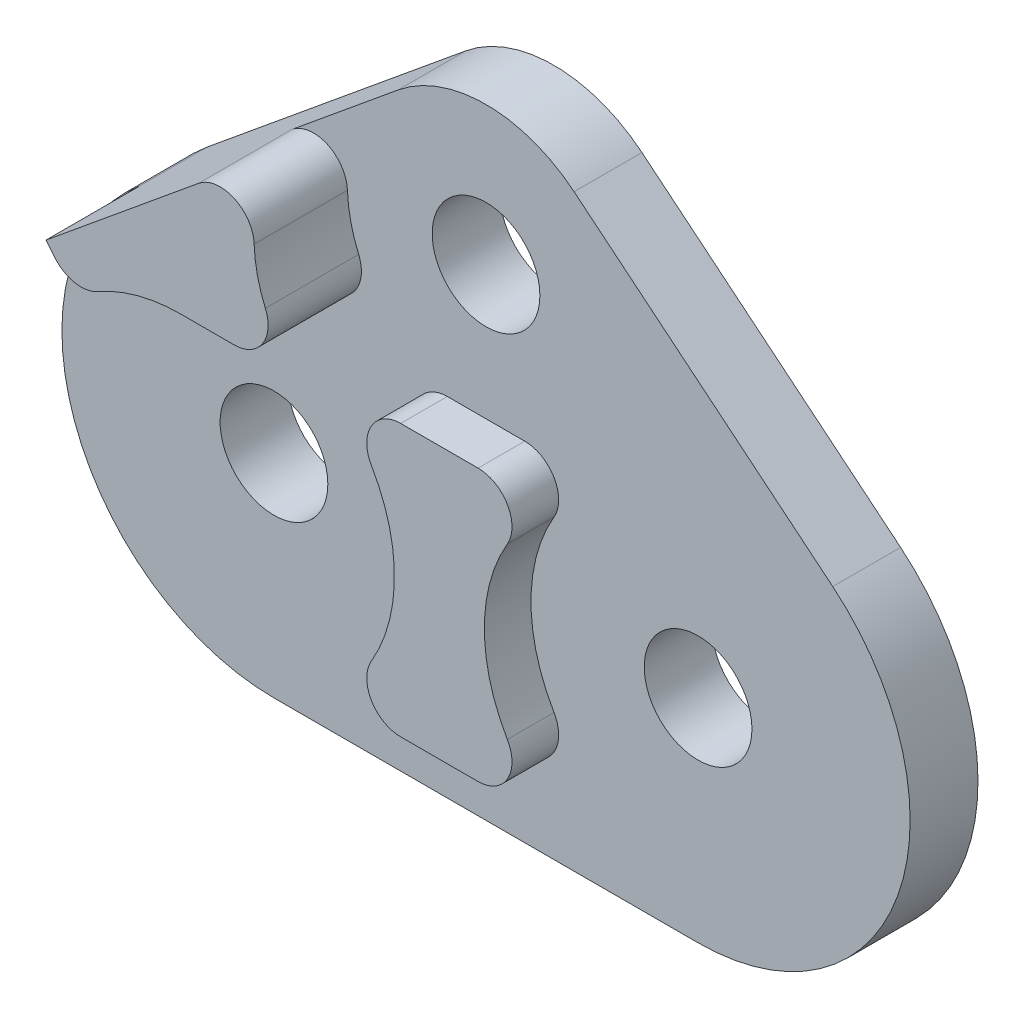
ISO-10303-21;
HEADER;
FILE_DESCRIPTION(('STEP AP214'),'2;1');
FILE_NAME('part.step','',(''),(''),'','','');
FILE_SCHEMA(('AUTOMOTIVE_DESIGN { 1 0 10303 214 1 1 1 1 }'));
ENDSEC;
DATA;
#1=APPLICATION_CONTEXT('core data for automotive mechanical design processes');
#2=APPLICATION_PROTOCOL_DEFINITION('international standard','automotive_design',2000,#1);
#3=PRODUCT_CONTEXT('',#1,'mechanical');
#4=PRODUCT('Part','Part','',(#3));
#5=PRODUCT_RELATED_PRODUCT_CATEGORY('part','',(#4));
#6=PRODUCT_DEFINITION_FORMATION('','',#4);
#7=PRODUCT_DEFINITION_CONTEXT('part definition',#1,'design');
#8=PRODUCT_DEFINITION('design','',#6,#7);
#9=PRODUCT_DEFINITION_SHAPE('','',#8);
#10=(LENGTH_UNIT() NAMED_UNIT(*) SI_UNIT(.MILLI.,.METRE.));
#11=(NAMED_UNIT(*) PLANE_ANGLE_UNIT() SI_UNIT($,.RADIAN.));
#12=(NAMED_UNIT(*) SI_UNIT($,.STERADIAN.) SOLID_ANGLE_UNIT());
#13=UNCERTAINTY_MEASURE_WITH_UNIT(LENGTH_MEASURE(1.E-05),#10,'distance_accuracy_value','');
#14=(GEOMETRIC_REPRESENTATION_CONTEXT(3) GLOBAL_UNCERTAINTY_ASSIGNED_CONTEXT((#13)) GLOBAL_UNIT_ASSIGNED_CONTEXT((#10,
#11,#12)) REPRESENTATION_CONTEXT('',''));
#15=CARTESIAN_POINT('',(0.,0.,0.));
#16=DIRECTION('',(0.,0.,1.));
#17=DIRECTION('',(1.,0.,0.));
#18=AXIS2_PLACEMENT_3D('',#15,#16,#17);
#19=CARTESIAN_POINT('',(-6.25,0.,2.));
#20=DIRECTION('',(0.,0.,1.));
#21=DIRECTION('',(1.,0.,0.));
#22=AXIS2_PLACEMENT_3D('',#19,#20,#21);
#23=PLANE('',#22);
#24=CARTESIAN_POINT('',(-6.25,0.,2.));
#25=DIRECTION('',(0.,0.,1.));
#26=DIRECTION('',(1.,0.,0.));
#27=AXIS2_PLACEMENT_3D('',#24,#25,#26);
#28=CIRCLE('',#27,4.925);
#29=CARTESIAN_POINT('',(-6.25,4.925,2.));
#30=VERTEX_POINT('',#29);
#31=CARTESIAN_POINT('',(-8.69062544198792,4.27772982455896,2.));
#32=VERTEX_POINT('',#31);
#33=EDGE_CURVE('E332',#30,#32,#28,.T.);
#34=ORIENTED_EDGE('',*,*,#33,.T.);
#35=CARTESIAN_POINT('',(-9.18618390736618,5.14630440822576,2.));
#36=DIRECTION('',(0.,0.,1.));
#37=DIRECTION('',(1.,0.,0.));
#38=AXIS2_PLACEMENT_3D('',#35,#36,#37);
#39=CIRCLE('',#38,1.);
#40=CARTESIAN_POINT('',(-9.95865968160112,4.51126017494738,2.));
#41=VERTEX_POINT('',#40);
#42=EDGE_CURVE('E326',#32,#41,#39,.F.);
#43=ORIENTED_EDGE('',*,*,#42,.T.);
#44=DIRECTION('',(-0.635044233278378,0.772475774234945,0.));
#45=VECTOR('',#44,1.);
#46=CARTESIAN_POINT('',(-3.72949263612424,-3.06597678609471,2.));
#47=LINE('',#46,#45);
#48=CARTESIAN_POINT('',(-10.2190264579899,4.8279735889684,2.));
#49=VERTEX_POINT('',#48);
#50=EDGE_CURVE('E329',#41,#49,#47,.T.);
#51=ORIENTED_EDGE('',*,*,#50,.T.);
#52=CARTESIAN_POINT('',(-6.25,0.,2.));
#53=DIRECTION('',(0.,0.,1.));
#54=DIRECTION('',(1.,0.,0.));
#55=AXIS2_PLACEMENT_3D('',#52,#53,#54);
#56=CIRCLE('',#55,6.25);
#57=CARTESIAN_POINT('',(-6.25,-6.25,2.));
#58=VERTEX_POINT('',#57);
#59=EDGE_CURVE('E252',#49,#58,#56,.T.);
#60=ORIENTED_EDGE('',*,*,#59,.T.);
#61=DIRECTION('',(1.,0.,0.));
#62=VECTOR('',#61,1.);
#63=CARTESIAN_POINT('',(-6.25,-6.25,2.));
#64=LINE('',#63,#62);
#65=CARTESIAN_POINT('',(6.25,-6.25000000000001,2.));
#66=VERTEX_POINT('',#65);
#67=EDGE_CURVE('E254',#58,#66,#64,.T.);
#68=ORIENTED_EDGE('',*,*,#67,.T.);
#69=CARTESIAN_POINT('',(6.25,0.,2.));
#70=DIRECTION('',(0.,0.,1.));
#71=DIRECTION('',(-1.,0.,0.));
#72=AXIS2_PLACEMENT_3D('',#69,#70,#71);
#73=CIRCLE('',#72,6.25);
#74=CARTESIAN_POINT('',(10.2190264579899,4.8279735889684,2.));
#75=VERTEX_POINT('',#74);
#76=EDGE_CURVE('E257',#66,#75,#73,.T.);
#77=ORIENTED_EDGE('',*,*,#76,.T.);
#78=DIRECTION('',(0.772475774234944,-0.635044233278379,0.));
#79=VECTOR('',#78,1.);
#80=CARTESIAN_POINT('',(6.48953382186565,7.8939503750631,2.));
#81=LINE('',#80,#79);
#82=CARTESIAN_POINT('',(2.59574330352537,11.0949947271853,2.));
#83=VERTEX_POINT('',#82);
#84=EDGE_CURVE('E215',#83,#75,#81,.T.);
#85=ORIENTED_EDGE('',*,*,#84,.F.);
#86=CARTESIAN_POINT('',(0.,7.93750000000001,2.));
#87=DIRECTION('',(0.,0.,1.));
#88=DIRECTION('',(1.,0.,0.));
#89=AXIS2_PLACEMENT_3D('',#86,#87,#88);
#90=CIRCLE('',#89,4.0875);
#91=CARTESIAN_POINT('',(-2.59574330352537,11.0949947271853,2.));
#92=VERTEX_POINT('',#91);
#93=EDGE_CURVE('E220',#92,#83,#90,.F.);
#94=ORIENTED_EDGE('',*,*,#93,.F.);
#95=DIRECTION('',(0.772475774234944,0.635044233278379,0.));
#96=VECTOR('',#95,1.);
#97=CARTESIAN_POINT('',(-6.48953382186565,7.8939503750631,2.));
#98=LINE('',#97,#96);
#99=CARTESIAN_POINT('',(-5.71925938898115,8.52718490870208,2.));
#100=VERTEX_POINT('',#99);
#101=EDGE_CURVE('E314',#100,#92,#98,.T.);
#102=ORIENTED_EDGE('',*,*,#101,.F.);
#103=CARTESIAN_POINT('',(-5.08421515570277,7.75470913446713,2.));
#104=DIRECTION('',(0.,0.,1.));
#105=DIRECTION('',(1.,0.,0.));
#106=AXIS2_PLACEMENT_3D('',#103,#104,#105);
#107=CIRCLE('',#106,1.);
#108=CARTESIAN_POINT('',(-4.0848608253435,7.79063854292568,2.));
#109=VERTEX_POINT('',#108);
#110=EDGE_CURVE('E11',#100,#109,#107,.F.);
#111=ORIENTED_EDGE('',*,*,#110,.T.);
#112=CARTESIAN_POINT('',(0.,7.93750000000001,2.));
#113=DIRECTION('',(0.,0.,1.));
#114=DIRECTION('',(1.,0.,0.));
#115=AXIS2_PLACEMENT_3D('',#112,#113,#114);
#116=CIRCLE('',#115,4.0875);
#117=CARTESIAN_POINT('',(-3.75409343800966,6.32057739557739,2.));
#118=VERTEX_POINT('',#117);
#119=EDGE_CURVE('E335',#118,#109,#116,.F.);
#120=ORIENTED_EDGE('',*,*,#119,.F.);
#121=CARTESIAN_POINT('',(-4.67252608339429,5.925,2.));
#122=DIRECTION('',(0.,0.,1.));
#123=DIRECTION('',(1.,0.,0.));
#124=AXIS2_PLACEMENT_3D('',#121,#122,#123);
#125=CIRCLE('',#124,1.);
#126=CARTESIAN_POINT('',(-4.67252608339429,4.925,2.));
#127=VERTEX_POINT('',#126);
#128=EDGE_CURVE('E42',#118,#127,#125,.F.);
#129=ORIENTED_EDGE('',*,*,#128,.T.);
#130=DIRECTION('',(1.,0.,0.));
#131=VECTOR('',#130,1.);
#132=CARTESIAN_POINT('',(0.,4.925,2.));
#133=LINE('',#132,#131);
#134=EDGE_CURVE('E346',#30,#127,#133,.T.);
#135=ORIENTED_EDGE('',*,*,#134,.F.);
#136=EDGE_LOOP('',(#34,#43,#51,#60,#68,#77,#85,#94,#102,#111,#120,#129,#135));
#137=FACE_BOUND('',#136,.T.);
#138=CARTESIAN_POINT('',(6.25,0.,2.));
#139=DIRECTION('',(0.,0.,1.));
#140=DIRECTION('',(1.,0.,0.));
#141=AXIS2_PLACEMENT_3D('',#138,#139,#140);
#142=CIRCLE('',#141,1.5875);
#143=CARTESIAN_POINT('',(7.8375,0.,2.));
#144=VERTEX_POINT('',#143);
#145=EDGE_CURVE('E232',#144,#144,#142,.T.);
#146=ORIENTED_EDGE('',*,*,#145,.F.);
#147=EDGE_LOOP('',(#146));
#148=FACE_BOUND('',#147,.T.);
#149=CARTESIAN_POINT('',(-6.25,0.,2.));
#150=DIRECTION('',(0.,0.,1.));
#151=DIRECTION('',(1.,0.,0.));
#152=AXIS2_PLACEMENT_3D('',#149,#150,#151);
#153=CIRCLE('',#152,1.5875);
#154=CARTESIAN_POINT('',(-4.6625,0.,2.));
#155=VERTEX_POINT('',#154);
#156=EDGE_CURVE('E243',#155,#155,#153,.T.);
#157=ORIENTED_EDGE('',*,*,#156,.F.);
#158=EDGE_LOOP('',(#157));
#159=FACE_BOUND('',#158,.T.);
#160=CARTESIAN_POINT('',(0.,7.93750000000001,2.));
#161=DIRECTION('',(0.,0.,1.));
#162=DIRECTION('',(1.,0.,0.));
#163=AXIS2_PLACEMENT_3D('',#160,#161,#162);
#164=CIRCLE('',#163,1.5875);
#165=CARTESIAN_POINT('',(1.5875,7.93750000000001,2.));
#166=VERTEX_POINT('',#165);
#167=EDGE_CURVE('E224',#166,#166,#164,.T.);
#168=ORIENTED_EDGE('',*,*,#167,.F.);
#169=EDGE_LOOP('',(#168));
#170=FACE_BOUND('',#169,.T.);
#171=DIRECTION('',(1.,0.,0.));
#172=VECTOR('',#171,1.);
#173=CARTESIAN_POINT('',(-3.3767396567662,-4.,2.));
#174=LINE('',#173,#172);
#175=CARTESIAN_POINT('',(-1.14063360092467,-4.,2.));
#176=VERTEX_POINT('',#175);
#177=CARTESIAN_POINT('',(1.14063360092467,-4.,2.));
#178=VERTEX_POINT('',#177);
#179=EDGE_CURVE('E362',#176,#178,#174,.T.);
#180=ORIENTED_EDGE('',*,*,#179,.F.);
#181=CARTESIAN_POINT('',(-1.14063360092467,-3.,2.));
#182=DIRECTION('',(0.,0.,1.));
#183=DIRECTION('',(1.,0.,0.));
#184=AXIS2_PLACEMENT_3D('',#181,#182,#183);
#185=CIRCLE('',#184,1.);
#186=CARTESIAN_POINT('',(-2.00297392144371,-2.49367088607595,2.));
#187=VERTEX_POINT('',#186);
#188=EDGE_CURVE('E318',#176,#187,#185,.F.);
#189=ORIENTED_EDGE('',*,*,#188,.T.);
#190=CARTESIAN_POINT('',(-6.25,0.,2.));
#191=DIRECTION('',(0.,0.,-1.));
#192=DIRECTION('',(-1.,0.,0.));
#193=AXIS2_PLACEMENT_3D('',#190,#191,#192);
#194=CIRCLE('',#193,4.925);
#195=CARTESIAN_POINT('',(-2.00297392144371,2.49367088607595,2.));
#196=VERTEX_POINT('',#195);
#197=EDGE_CURVE('E365',#196,#187,#194,.T.);
#198=ORIENTED_EDGE('',*,*,#197,.F.);
#199=CARTESIAN_POINT('',(-1.14063360092467,3.,2.));
#200=DIRECTION('',(0.,0.,1.));
#201=DIRECTION('',(1.,0.,0.));
#202=AXIS2_PLACEMENT_3D('',#199,#200,#201);
#203=CIRCLE('',#202,1.);
#204=CARTESIAN_POINT('',(-1.14063360092467,4.,2.));
#205=VERTEX_POINT('',#204);
#206=EDGE_CURVE('E324',#196,#205,#203,.F.);
#207=ORIENTED_EDGE('',*,*,#206,.T.);
#208=DIRECTION('',(-1.,0.,0.));
#209=VECTOR('',#208,1.);
#210=CARTESIAN_POINT('',(-3.3767396567662,4.,2.));
#211=LINE('',#210,#209);
#212=CARTESIAN_POINT('',(1.14063360092467,4.,2.));
#213=VERTEX_POINT('',#212);
#214=EDGE_CURVE('E355',#213,#205,#211,.T.);
#215=ORIENTED_EDGE('',*,*,#214,.F.);
#216=CARTESIAN_POINT('',(1.14063360092467,3.,2.));
#217=DIRECTION('',(0.,0.,1.));
#218=DIRECTION('',(1.,0.,0.));
#219=AXIS2_PLACEMENT_3D('',#216,#217,#218);
#220=CIRCLE('',#219,1.);
#221=CARTESIAN_POINT('',(2.00297392144372,2.49367088607595,2.));
#222=VERTEX_POINT('',#221);
#223=EDGE_CURVE('E322',#213,#222,#220,.F.);
#224=ORIENTED_EDGE('',*,*,#223,.T.);
#225=CARTESIAN_POINT('',(6.25,0.,2.));
#226=DIRECTION('',(0.,0.,-1.));
#227=DIRECTION('',(1.,0.,0.));
#228=AXIS2_PLACEMENT_3D('',#225,#226,#227);
#229=CIRCLE('',#228,4.925);
#230=CARTESIAN_POINT('',(2.00297392144371,-2.49367088607595,2.));
#231=VERTEX_POINT('',#230);
#232=EDGE_CURVE('E359',#231,#222,#229,.T.);
#233=ORIENTED_EDGE('',*,*,#232,.F.);
#234=CARTESIAN_POINT('',(1.14063360092467,-3.,2.));
#235=DIRECTION('',(0.,0.,1.));
#236=DIRECTION('',(1.,0.,0.));
#237=AXIS2_PLACEMENT_3D('',#234,#235,#236);
#238=CIRCLE('',#237,1.);
#239=EDGE_CURVE('E320',#231,#178,#238,.F.);
#240=ORIENTED_EDGE('',*,*,#239,.T.);
#241=EDGE_LOOP('',(#180,#189,#198,#207,#215,#224,#233,#240));
#242=FACE_BOUND('',#241,.T.);
#243=ADVANCED_FACE('F34',(#137,#148,#159,#170,#242),#23,.T.);
#244=CARTESIAN_POINT('',(6.25,0.,2.));
#245=DIRECTION('',(0.,0.,-1.));
#246=DIRECTION('',(-1.,0.,0.));
#247=AXIS2_PLACEMENT_3D('',#244,#245,#246);
#248=CYLINDRICAL_SURFACE('',#247,6.25);
#249=DIRECTION('',(0.,0.,1.));
#250=VECTOR('',#249,1.);
#251=CARTESIAN_POINT('',(10.2190264579899,4.8279735889684,-21.668207036058));
#252=LINE('',#251,#250);
#253=CARTESIAN_POINT('',(10.2190264579899,4.8279735889684,0.));
#254=VERTEX_POINT('',#253);
#255=EDGE_CURVE('E218',#254,#75,#252,.T.);
#256=ORIENTED_EDGE('',*,*,#255,.T.);
#257=ORIENTED_EDGE('',*,*,#76,.F.);
#258=DIRECTION('',(0.,0.,-1.));
#259=VECTOR('',#258,1.);
#260=CARTESIAN_POINT('',(6.25,-6.25000000000001,2.));
#261=LINE('',#260,#259);
#262=CARTESIAN_POINT('',(6.25,-6.25000000000001,0.));
#263=VERTEX_POINT('',#262);
#264=EDGE_CURVE('E260',#66,#263,#261,.T.);
#265=ORIENTED_EDGE('',*,*,#264,.T.);
#266=CARTESIAN_POINT('',(6.25,0.,0.));
#267=DIRECTION('',(0.,0.,1.));
#268=DIRECTION('',(-1.,0.,0.));
#269=AXIS2_PLACEMENT_3D('',#266,#267,#268);
#270=CIRCLE('',#269,6.25);
#271=EDGE_CURVE('E255',#263,#254,#270,.T.);
#272=ORIENTED_EDGE('',*,*,#271,.T.);
#273=EDGE_LOOP('',(#256,#257,#265,#272));
#274=FACE_BOUND('',#273,.T.);
#275=ADVANCED_FACE('F425',(#274),#248,.T.);
#276=CARTESIAN_POINT('',(-6.25,0.,2.));
#277=DIRECTION('',(0.,0.,-1.));
#278=DIRECTION('',(-1.,0.,0.));
#279=AXIS2_PLACEMENT_3D('',#276,#277,#278);
#280=CYLINDRICAL_SURFACE('',#279,6.25);
#281=ORIENTED_EDGE('',*,*,#59,.F.);
#282=DIRECTION('',(0.,0.,1.));
#283=VECTOR('',#282,1.);
#284=CARTESIAN_POINT('',(-10.2190264579899,4.8279735889684,-21.668207036058));
#285=LINE('',#284,#283);
#286=CARTESIAN_POINT('',(-10.2190264579899,4.8279735889684,0.));
#287=VERTEX_POINT('',#286);
#288=EDGE_CURVE('E204',#287,#49,#285,.T.);
#289=ORIENTED_EDGE('',*,*,#288,.F.);
#290=CARTESIAN_POINT('',(-6.25,0.,0.));
#291=DIRECTION('',(0.,0.,1.));
#292=DIRECTION('',(1.,0.,0.));
#293=AXIS2_PLACEMENT_3D('',#290,#291,#292);
#294=CIRCLE('',#293,6.25);
#295=CARTESIAN_POINT('',(-6.25,-6.25,0.));
#296=VERTEX_POINT('',#295);
#297=EDGE_CURVE('E249',#287,#296,#294,.T.);
#298=ORIENTED_EDGE('',*,*,#297,.T.);
#299=DIRECTION('',(0.,0.,-1.));
#300=VECTOR('',#299,1.);
#301=CARTESIAN_POINT('',(-6.25,-6.25,2.));
#302=LINE('',#301,#300);
#303=EDGE_CURVE('E267',#58,#296,#302,.T.);
#304=ORIENTED_EDGE('',*,*,#303,.F.);
#305=EDGE_LOOP('',(#281,#289,#298,#304));
#306=FACE_BOUND('',#305,.T.);
#307=ADVANCED_FACE('F430',(#306),#280,.T.);
#308=CARTESIAN_POINT('',(-6.25,-6.25,2.));
#309=DIRECTION('',(0.,1.,0.));
#310=DIRECTION('',(0.,0.,1.));
#311=AXIS2_PLACEMENT_3D('',#308,#309,#310);
#312=PLANE('',#311);
#313=DIRECTION('',(1.,0.,0.));
#314=VECTOR('',#313,1.);
#315=CARTESIAN_POINT('',(-6.25,-6.25,0.));
#316=LINE('',#315,#314);
#317=EDGE_CURVE('E262',#296,#263,#316,.T.);
#318=ORIENTED_EDGE('',*,*,#317,.T.);
#319=ORIENTED_EDGE('',*,*,#264,.F.);
#320=ORIENTED_EDGE('',*,*,#67,.F.);
#321=ORIENTED_EDGE('',*,*,#303,.T.);
#322=EDGE_LOOP('',(#318,#319,#320,#321));
#323=FACE_BOUND('',#322,.T.);
#324=ADVANCED_FACE('F439',(#323),#312,.F.);
#325=CARTESIAN_POINT('',(-6.25,0.,0.));
#326=DIRECTION('',(0.,0.,1.));
#327=DIRECTION('',(1.,0.,0.));
#328=AXIS2_PLACEMENT_3D('',#325,#326,#327);
#329=PLANE('',#328);
#330=DIRECTION('',(-0.772475774234944,0.635044233278379,0.));
#331=VECTOR('',#330,1.);
#332=CARTESIAN_POINT('',(6.48953382186565,7.8939503750631,0.));
#333=LINE('',#332,#331);
#334=CARTESIAN_POINT('',(2.59574330352537,11.0949947271853,0.));
#335=VERTEX_POINT('',#334);
#336=EDGE_CURVE('E223',#254,#335,#333,.T.);
#337=ORIENTED_EDGE('',*,*,#336,.F.);
#338=ORIENTED_EDGE('',*,*,#271,.F.);
#339=ORIENTED_EDGE('',*,*,#317,.F.);
#340=ORIENTED_EDGE('',*,*,#297,.F.);
#341=DIRECTION('',(0.772475774234944,0.635044233278379,0.));
#342=VECTOR('',#341,1.);
#343=CARTESIAN_POINT('',(-6.48953382186565,7.8939503750631,0.));
#344=LINE('',#343,#342);
#345=CARTESIAN_POINT('',(-2.59574330352537,11.0949947271853,0.));
#346=VERTEX_POINT('',#345);
#347=EDGE_CURVE('E230',#287,#346,#344,.T.);
#348=ORIENTED_EDGE('',*,*,#347,.T.);
#349=CARTESIAN_POINT('',(0.,7.93750000000001,0.));
#350=DIRECTION('',(0.,0.,1.));
#351=DIRECTION('',(1.,0.,0.));
#352=AXIS2_PLACEMENT_3D('',#349,#350,#351);
#353=CIRCLE('',#352,4.0875);
#354=EDGE_CURVE('E205',#335,#346,#353,.T.);
#355=ORIENTED_EDGE('',*,*,#354,.F.);
#356=EDGE_LOOP('',(#337,#338,#339,#340,#348,#355));
#357=FACE_BOUND('',#356,.T.);
#358=CARTESIAN_POINT('',(6.25,0.,0.));
#359=DIRECTION('',(0.,0.,1.));
#360=DIRECTION('',(1.,0.,0.));
#361=AXIS2_PLACEMENT_3D('',#358,#359,#360);
#362=CIRCLE('',#361,1.5875);
#363=CARTESIAN_POINT('',(7.8375,0.,0.));
#364=VERTEX_POINT('',#363);
#365=EDGE_CURVE('E240',#364,#364,#362,.T.);
#366=ORIENTED_EDGE('',*,*,#365,.T.);
#367=EDGE_LOOP('',(#366));
#368=FACE_BOUND('',#367,.T.);
#369=CARTESIAN_POINT('',(-6.25,0.,0.));
#370=DIRECTION('',(0.,0.,1.));
#371=DIRECTION('',(1.,0.,0.));
#372=AXIS2_PLACEMENT_3D('',#369,#370,#371);
#373=CIRCLE('',#372,1.5875);
#374=CARTESIAN_POINT('',(-4.6625,0.,0.));
#375=VERTEX_POINT('',#374);
#376=EDGE_CURVE('E246',#375,#375,#373,.T.);
#377=ORIENTED_EDGE('',*,*,#376,.T.);
#378=EDGE_LOOP('',(#377));
#379=FACE_BOUND('',#378,.T.);
#380=CARTESIAN_POINT('',(0.,7.93750000000001,0.));
#381=DIRECTION('',(0.,0.,1.));
#382=DIRECTION('',(1.,0.,0.));
#383=AXIS2_PLACEMENT_3D('',#380,#381,#382);
#384=CIRCLE('',#383,1.5875);
#385=CARTESIAN_POINT('',(1.5875,7.93750000000001,0.));
#386=VERTEX_POINT('',#385);
#387=EDGE_CURVE('E227',#386,#386,#384,.F.);
#388=ORIENTED_EDGE('',*,*,#387,.F.);
#389=EDGE_LOOP('',(#388));
#390=FACE_BOUND('',#389,.T.);
#391=ADVANCED_FACE('F437',(#357,#368,#379,#390),#329,.F.);
#392=CARTESIAN_POINT('',(-6.25,0.,0.));
#393=DIRECTION('',(0.,0.,1.));
#394=DIRECTION('',(1.,0.,0.));
#395=AXIS2_PLACEMENT_3D('',#392,#393,#394);
#396=CYLINDRICAL_SURFACE('',#395,1.5875);
#397=ORIENTED_EDGE('',*,*,#376,.F.);
#398=EDGE_LOOP('',(#397));
#399=FACE_BOUND('',#398,.T.);
#400=ORIENTED_EDGE('',*,*,#156,.T.);
#401=EDGE_LOOP('',(#400));
#402=FACE_BOUND('',#401,.T.);
#403=ADVANCED_FACE('F435',(#399,#402),#396,.F.);
#404=CARTESIAN_POINT('',(6.25,0.,0.));
#405=DIRECTION('',(0.,0.,1.));
#406=DIRECTION('',(1.,0.,0.));
#407=AXIS2_PLACEMENT_3D('',#404,#405,#406);
#408=CYLINDRICAL_SURFACE('',#407,1.5875);
#409=ORIENTED_EDGE('',*,*,#365,.F.);
#410=EDGE_LOOP('',(#409));
#411=FACE_BOUND('',#410,.T.);
#412=ORIENTED_EDGE('',*,*,#145,.T.);
#413=EDGE_LOOP('',(#412));
#414=FACE_BOUND('',#413,.T.);
#415=ADVANCED_FACE('F494',(#411,#414),#408,.F.);
#416=CARTESIAN_POINT('',(0.,7.93750000000001,-21.668207036058));
#417=DIRECTION('',(0.,0.,1.));
#418=DIRECTION('',(1.,0.,0.));
#419=AXIS2_PLACEMENT_3D('',#416,#417,#418);
#420=CYLINDRICAL_SURFACE('',#419,4.0875);
#421=DIRECTION('',(0.,0.,1.));
#422=VECTOR('',#421,1.);
#423=CARTESIAN_POINT('',(2.59574330352537,11.0949947271853,-21.668207036058));
#424=LINE('',#423,#422);
#425=EDGE_CURVE('E219',#335,#83,#424,.T.);
#426=ORIENTED_EDGE('',*,*,#425,.F.);
#427=ORIENTED_EDGE('',*,*,#354,.T.);
#428=DIRECTION('',(0.,0.,1.));
#429=VECTOR('',#428,1.);
#430=CARTESIAN_POINT('',(-2.59574330352537,11.0949947271853,-21.668207036058));
#431=LINE('',#430,#429);
#432=EDGE_CURVE('E209',#346,#92,#431,.T.);
#433=ORIENTED_EDGE('',*,*,#432,.T.);
#434=ORIENTED_EDGE('',*,*,#93,.T.);
#435=EDGE_LOOP('',(#426,#427,#433,#434));
#436=FACE_BOUND('',#435,.T.);
#437=ADVANCED_FACE('F473',(#436),#420,.T.);
#438=CARTESIAN_POINT('',(6.48953382186565,7.8939503750631,-21.668207036058));
#439=DIRECTION('',(-0.635044233278379,-0.772475774234944,0.));
#440=DIRECTION('',(0.772475774234944,-0.635044233278379,0.));
#441=AXIS2_PLACEMENT_3D('',#438,#439,#440);
#442=PLANE('',#441);
#443=ORIENTED_EDGE('',*,*,#255,.F.);
#444=ORIENTED_EDGE('',*,*,#336,.T.);
#445=ORIENTED_EDGE('',*,*,#425,.T.);
#446=ORIENTED_EDGE('',*,*,#84,.T.);
#447=EDGE_LOOP('',(#443,#444,#445,#446));
#448=FACE_BOUND('',#447,.T.);
#449=ADVANCED_FACE('F479',(#448),#442,.F.);
#450=CARTESIAN_POINT('',(0.,7.93750000000001,-21.668207036058));
#451=DIRECTION('',(0.,0.,1.));
#452=DIRECTION('',(1.,0.,0.));
#453=AXIS2_PLACEMENT_3D('',#450,#451,#452);
#454=CYLINDRICAL_SURFACE('',#453,1.5875);
#455=ORIENTED_EDGE('',*,*,#387,.T.);
#456=EDGE_LOOP('',(#455));
#457=FACE_BOUND('',#456,.T.);
#458=ORIENTED_EDGE('',*,*,#167,.T.);
#459=EDGE_LOOP('',(#458));
#460=FACE_BOUND('',#459,.T.);
#461=ADVANCED_FACE('F486',(#457,#460),#454,.F.);
#462=CARTESIAN_POINT('',(-6.48953382186565,7.8939503750631,-21.668207036058));
#463=DIRECTION('',(-0.635044233278379,0.772475774234944,0.));
#464=DIRECTION('',(-0.772475774234944,-0.635044233278379,0.));
#465=AXIS2_PLACEMENT_3D('',#462,#463,#464);
#466=PLANE('',#465);
#467=DIRECTION('',(-0.772475774234944,-0.635044233278379,0.));
#468=VECTOR('',#467,1.);
#469=CARTESIAN_POINT('',(-6.48953382186564,7.8939503750631,4.75));
#470=LINE('',#469,#468);
#471=CARTESIAN_POINT('',(-5.71925938898115,8.52718490870208,4.75));
#472=VERTEX_POINT('',#471);
#473=CARTESIAN_POINT('',(-10.2190264579899,4.8279735889684,4.75));
#474=VERTEX_POINT('',#473);
#475=EDGE_CURVE('E178',#472,#474,#470,.T.);
#476=ORIENTED_EDGE('',*,*,#475,.F.);
#477=DIRECTION('',(0.,0.,1.));
#478=VECTOR('',#477,1.);
#479=CARTESIAN_POINT('',(-5.71925938898115,8.52718490870208,2.));
#480=LINE('',#479,#478);
#481=EDGE_CURVE('E316',#472,#100,#480,.F.);
#482=ORIENTED_EDGE('',*,*,#481,.T.);
#483=ORIENTED_EDGE('',*,*,#101,.T.);
#484=ORIENTED_EDGE('',*,*,#432,.F.);
#485=ORIENTED_EDGE('',*,*,#347,.F.);
#486=ORIENTED_EDGE('',*,*,#288,.T.);
#487=DIRECTION('',(0.,0.,-1.));
#488=VECTOR('',#487,1.);
#489=CARTESIAN_POINT('',(-10.2190264579899,4.8279735889684,4.75));
#490=LINE('',#489,#488);
#491=EDGE_CURVE('E195',#474,#49,#490,.T.);
#492=ORIENTED_EDGE('',*,*,#491,.F.);
#493=EDGE_LOOP('',(#476,#482,#483,#484,#485,#486,#492));
#494=FACE_BOUND('',#493,.T.);
#495=ADVANCED_FACE('F201',(#494),#466,.T.);
#496=CARTESIAN_POINT('',(0.,4.925,4.75));
#497=DIRECTION('',(0.,1.,0.));
#498=DIRECTION('',(0.,0.,1.));
#499=AXIS2_PLACEMENT_3D('',#496,#497,#498);
#500=PLANE('',#499);
#501=ORIENTED_EDGE('',*,*,#134,.T.);
#502=DIRECTION('',(0.,0.,-1.));
#503=VECTOR('',#502,1.);
#504=CARTESIAN_POINT('',(-4.67252608339429,4.925,4.75));
#505=LINE('',#504,#503);
#506=CARTESIAN_POINT('',(-4.67252608339429,4.925,4.75));
#507=VERTEX_POINT('',#506);
#508=EDGE_CURVE('E312',#127,#507,#505,.F.);
#509=ORIENTED_EDGE('',*,*,#508,.T.);
#510=DIRECTION('',(1.,0.,0.));
#511=VECTOR('',#510,1.);
#512=CARTESIAN_POINT('',(0.,4.925,4.75));
#513=LINE('',#512,#511);
#514=CARTESIAN_POINT('',(-6.25,4.925,4.75));
#515=VERTEX_POINT('',#514);
#516=EDGE_CURVE('E350',#515,#507,#513,.T.);
#517=ORIENTED_EDGE('',*,*,#516,.F.);
#518=DIRECTION('',(0.,0.,-1.));
#519=VECTOR('',#518,1.);
#520=CARTESIAN_POINT('',(-6.25,4.925,4.75));
#521=LINE('',#520,#519);
#522=EDGE_CURVE('E206',#515,#30,#521,.T.);
#523=ORIENTED_EDGE('',*,*,#522,.T.);
#524=EDGE_LOOP('',(#501,#509,#517,#523));
#525=FACE_BOUND('',#524,.T.);
#526=ADVANCED_FACE('F572',(#525),#500,.F.);
#527=CARTESIAN_POINT('',(0.,7.93750000000001,4.75));
#528=DIRECTION('',(0.,0.,-1.));
#529=DIRECTION('',(-1.,0.,0.));
#530=AXIS2_PLACEMENT_3D('',#527,#528,#529);
#531=CYLINDRICAL_SURFACE('',#530,4.0875);
#532=CARTESIAN_POINT('',(0.,7.93750000000001,4.75));
#533=DIRECTION('',(0.,0.,1.));
#534=DIRECTION('',(1.,0.,0.));
#535=AXIS2_PLACEMENT_3D('',#532,#533,#534);
#536=CIRCLE('',#535,4.0875);
#537=CARTESIAN_POINT('',(-3.75409343800966,6.32057739557739,4.75));
#538=VERTEX_POINT('',#537);
#539=CARTESIAN_POINT('',(-4.0848608253435,7.79063854292568,4.75));
#540=VERTEX_POINT('',#539);
#541=EDGE_CURVE('E189',#538,#540,#536,.F.);
#542=ORIENTED_EDGE('',*,*,#541,.F.);
#543=DIRECTION('',(0.,0.,-1.));
#544=VECTOR('',#543,1.);
#545=CARTESIAN_POINT('',(-3.75409343800966,6.32057739557739,4.75));
#546=LINE('',#545,#544);
#547=EDGE_CURVE('E309',#538,#118,#546,.T.);
#548=ORIENTED_EDGE('',*,*,#547,.T.);
#549=ORIENTED_EDGE('',*,*,#119,.T.);
#550=DIRECTION('',(0.,0.,-1.));
#551=VECTOR('',#550,1.);
#552=CARTESIAN_POINT('',(-4.0848608253435,7.79063854292568,4.75));
#553=LINE('',#552,#551);
#554=EDGE_CURVE('E307',#109,#540,#553,.F.);
#555=ORIENTED_EDGE('',*,*,#554,.T.);
#556=EDGE_LOOP('',(#542,#548,#549,#555));
#557=FACE_BOUND('',#556,.T.);
#558=ADVANCED_FACE('F467',(#557),#531,.F.);
#559=CARTESIAN_POINT('',(-3.72949263612424,-3.06597678609471,4.75));
#560=DIRECTION('',(-0.772475774234945,-0.635044233278378,0.));
#561=DIRECTION('',(0.635044233278378,-0.772475774234945,0.));
#562=AXIS2_PLACEMENT_3D('',#559,#560,#561);
#563=PLANE('',#562);
#564=ORIENTED_EDGE('',*,*,#50,.F.);
#565=DIRECTION('',(0.,0.,-1.));
#566=VECTOR('',#565,1.);
#567=CARTESIAN_POINT('',(-9.95865968160112,4.51126017494738,4.75));
#568=LINE('',#567,#566);
#569=CARTESIAN_POINT('',(-9.95865968160112,4.51126017494738,4.75));
#570=VERTEX_POINT('',#569);
#571=EDGE_CURVE('E197',#41,#570,#568,.F.);
#572=ORIENTED_EDGE('',*,*,#571,.T.);
#573=DIRECTION('',(-0.635044233278378,0.772475774234945,0.));
#574=VECTOR('',#573,1.);
#575=CARTESIAN_POINT('',(-3.72949263612424,-3.06597678609471,4.75));
#576=LINE('',#575,#574);
#577=EDGE_CURVE('E181',#570,#474,#576,.T.);
#578=ORIENTED_EDGE('',*,*,#577,.T.);
#579=ORIENTED_EDGE('',*,*,#491,.T.);
#580=EDGE_LOOP('',(#564,#572,#578,#579));
#581=FACE_BOUND('',#580,.T.);
#582=ADVANCED_FACE('F194',(#581),#563,.T.);
#583=CARTESIAN_POINT('',(-6.25,0.,4.75));
#584=DIRECTION('',(0.,0.,-1.));
#585=DIRECTION('',(-1.,0.,0.));
#586=AXIS2_PLACEMENT_3D('',#583,#584,#585);
#587=CYLINDRICAL_SURFACE('',#586,4.925);
#588=CARTESIAN_POINT('',(-6.25,0.,4.75));
#589=DIRECTION('',(0.,0.,1.));
#590=DIRECTION('',(1.,0.,0.));
#591=AXIS2_PLACEMENT_3D('',#588,#589,#590);
#592=CIRCLE('',#591,4.925);
#593=CARTESIAN_POINT('',(-8.69062544198792,4.27772982455896,4.75));
#594=VERTEX_POINT('',#593);
#595=EDGE_CURVE('E198',#515,#594,#592,.T.);
#596=ORIENTED_EDGE('',*,*,#595,.T.);
#597=DIRECTION('',(0.,0.,-1.));
#598=VECTOR('',#597,1.);
#599=CARTESIAN_POINT('',(-8.69062544198792,4.27772982455896,4.75));
#600=LINE('',#599,#598);
#601=EDGE_CURVE('E298',#594,#32,#600,.T.);
#602=ORIENTED_EDGE('',*,*,#601,.T.);
#603=ORIENTED_EDGE('',*,*,#33,.F.);
#604=ORIENTED_EDGE('',*,*,#522,.F.);
#605=EDGE_LOOP('',(#596,#602,#603,#604));
#606=FACE_BOUND('',#605,.T.);
#607=ADVANCED_FACE('F342',(#606),#587,.F.);
#608=CARTESIAN_POINT('',(0.,0.,4.75));
#609=DIRECTION('',(0.,0.,1.));
#610=DIRECTION('',(1.,0.,0.));
#611=AXIS2_PLACEMENT_3D('',#608,#609,#610);
#612=PLANE('',#611);
#613=ORIENTED_EDGE('',*,*,#577,.F.);
#614=CARTESIAN_POINT('',(-9.18618390736618,5.14630440822576,4.75));
#615=DIRECTION('',(0.,0.,1.));
#616=DIRECTION('',(1.,0.,0.));
#617=AXIS2_PLACEMENT_3D('',#614,#615,#616);
#618=CIRCLE('',#617,1.);
#619=EDGE_CURVE('E305',#570,#594,#618,.T.);
#620=ORIENTED_EDGE('',*,*,#619,.T.);
#621=ORIENTED_EDGE('',*,*,#595,.F.);
#622=ORIENTED_EDGE('',*,*,#516,.T.);
#623=CARTESIAN_POINT('',(-4.67252608339429,5.925,4.75));
#624=DIRECTION('',(0.,0.,1.));
#625=DIRECTION('',(1.,0.,0.));
#626=AXIS2_PLACEMENT_3D('',#623,#624,#625);
#627=CIRCLE('',#626,1.);
#628=EDGE_CURVE('E303',#507,#538,#627,.T.);
#629=ORIENTED_EDGE('',*,*,#628,.T.);
#630=ORIENTED_EDGE('',*,*,#541,.T.);
#631=CARTESIAN_POINT('',(-5.08421515570277,7.75470913446713,4.75));
#632=DIRECTION('',(0.,0.,1.));
#633=DIRECTION('',(1.,0.,0.));
#634=AXIS2_PLACEMENT_3D('',#631,#632,#633);
#635=CIRCLE('',#634,1.);
#636=EDGE_CURVE('E185',#540,#472,#635,.T.);
#637=ORIENTED_EDGE('',*,*,#636,.T.);
#638=ORIENTED_EDGE('',*,*,#475,.T.);
#639=EDGE_LOOP('',(#613,#620,#621,#622,#629,#630,#637,#638));
#640=FACE_BOUND('',#639,.T.);
#641=ADVANCED_FACE('F180',(#640),#612,.T.);
#642=CARTESIAN_POINT('',(-6.25,0.,3.375));
#643=DIRECTION('',(0.,0.,-1.));
#644=DIRECTION('',(-1.,0.,0.));
#645=AXIS2_PLACEMENT_3D('',#642,#643,#644);
#646=CYLINDRICAL_SURFACE('',#645,4.925);
#647=ORIENTED_EDGE('',*,*,#197,.T.);
#648=DIRECTION('',(0.,0.,-1.));
#649=VECTOR('',#648,1.);
#650=CARTESIAN_POINT('',(-2.00297392144371,-2.49367088607595,3.375));
#651=LINE('',#650,#649);
#652=CARTESIAN_POINT('',(-2.00297392144371,-2.49367088607595,3.375));
#653=VERTEX_POINT('',#652);
#654=EDGE_CURVE('E278',#187,#653,#651,.F.);
#655=ORIENTED_EDGE('',*,*,#654,.T.);
#656=CARTESIAN_POINT('',(-6.25,0.,3.375));
#657=DIRECTION('',(0.,0.,-1.));
#658=DIRECTION('',(-1.,0.,0.));
#659=AXIS2_PLACEMENT_3D('',#656,#657,#658);
#660=CIRCLE('',#659,4.925);
#661=CARTESIAN_POINT('',(-2.00297392144371,2.49367088607595,3.375));
#662=VERTEX_POINT('',#661);
#663=EDGE_CURVE('E358',#662,#653,#660,.T.);
#664=ORIENTED_EDGE('',*,*,#663,.F.);
#665=DIRECTION('',(0.,0.,-1.));
#666=VECTOR('',#665,1.);
#667=CARTESIAN_POINT('',(-2.00297392144371,2.49367088607595,3.375));
#668=LINE('',#667,#666);
#669=EDGE_CURVE('E275',#662,#196,#668,.T.);
#670=ORIENTED_EDGE('',*,*,#669,.T.);
#671=EDGE_LOOP('',(#647,#655,#664,#670));
#672=FACE_BOUND('',#671,.T.);
#673=ADVANCED_FACE('F415',(#672),#646,.F.);
#674=CARTESIAN_POINT('',(-3.3767396567662,-4.,3.375));
#675=DIRECTION('',(0.,1.,0.));
#676=DIRECTION('',(-1.,0.,0.));
#677=AXIS2_PLACEMENT_3D('',#674,#675,#676);
#678=PLANE('',#677);
#679=DIRECTION('',(1.,0.,0.));
#680=VECTOR('',#679,1.);
#681=CARTESIAN_POINT('',(-3.3767396567662,-4.,3.375));
#682=LINE('',#681,#680);
#683=CARTESIAN_POINT('',(-1.14063360092467,-4.,3.375));
#684=VERTEX_POINT('',#683);
#685=CARTESIAN_POINT('',(1.14063360092467,-4.,3.375));
#686=VERTEX_POINT('',#685);
#687=EDGE_CURVE('E373',#684,#686,#682,.T.);
#688=ORIENTED_EDGE('',*,*,#687,.F.);
#689=DIRECTION('',(0.,0.,-1.));
#690=VECTOR('',#689,1.);
#691=CARTESIAN_POINT('',(-1.14063360092467,-4.,3.375));
#692=LINE('',#691,#690);
#693=EDGE_CURVE('E272',#684,#176,#692,.T.);
#694=ORIENTED_EDGE('',*,*,#693,.T.);
#695=ORIENTED_EDGE('',*,*,#179,.T.);
#696=DIRECTION('',(0.,0.,-1.));
#697=VECTOR('',#696,1.);
#698=CARTESIAN_POINT('',(1.14063360092467,-4.,3.375));
#699=LINE('',#698,#697);
#700=EDGE_CURVE('E270',#178,#686,#699,.F.);
#701=ORIENTED_EDGE('',*,*,#700,.T.);
#702=EDGE_LOOP('',(#688,#694,#695,#701));
#703=FACE_BOUND('',#702,.T.);
#704=ADVANCED_FACE('F391',(#703),#678,.F.);
#705=CARTESIAN_POINT('',(6.25,0.,3.375));
#706=DIRECTION('',(0.,0.,-1.));
#707=DIRECTION('',(-1.,0.,0.));
#708=AXIS2_PLACEMENT_3D('',#705,#706,#707);
#709=CYLINDRICAL_SURFACE('',#708,4.925);
#710=CARTESIAN_POINT('',(6.25,0.,3.375));
#711=DIRECTION('',(0.,0.,-1.));
#712=DIRECTION('',(1.,0.,0.));
#713=AXIS2_PLACEMENT_3D('',#710,#711,#712);
#714=CIRCLE('',#713,4.925);
#715=CARTESIAN_POINT('',(2.00297392144371,-2.49367088607595,3.375));
#716=VERTEX_POINT('',#715);
#717=CARTESIAN_POINT('',(2.00297392144372,2.49367088607595,3.375));
#718=VERTEX_POINT('',#717);
#719=EDGE_CURVE('E370',#716,#718,#714,.T.);
#720=ORIENTED_EDGE('',*,*,#719,.F.);
#721=DIRECTION('',(0.,0.,-1.));
#722=VECTOR('',#721,1.);
#723=CARTESIAN_POINT('',(2.00297392144371,-2.49367088607595,3.375));
#724=LINE('',#723,#722);
#725=EDGE_CURVE('E290',#716,#231,#724,.T.);
#726=ORIENTED_EDGE('',*,*,#725,.T.);
#727=ORIENTED_EDGE('',*,*,#232,.T.);
#728=DIRECTION('',(0.,0.,-1.));
#729=VECTOR('',#728,1.);
#730=CARTESIAN_POINT('',(2.00297392144371,2.49367088607595,3.375));
#731=LINE('',#730,#729);
#732=EDGE_CURVE('E288',#222,#718,#731,.F.);
#733=ORIENTED_EDGE('',*,*,#732,.T.);
#734=EDGE_LOOP('',(#720,#726,#727,#733));
#735=FACE_BOUND('',#734,.T.);
#736=ADVANCED_FACE('F402',(#735),#709,.F.);
#737=CARTESIAN_POINT('',(-3.3767396567662,4.,3.375));
#738=DIRECTION('',(0.,-1.,0.));
#739=DIRECTION('',(1.,0.,0.));
#740=AXIS2_PLACEMENT_3D('',#737,#738,#739);
#741=PLANE('',#740);
#742=DIRECTION('',(-1.,0.,0.));
#743=VECTOR('',#742,1.);
#744=CARTESIAN_POINT('',(-3.3767396567662,4.,3.375));
#745=LINE('',#744,#743);
#746=CARTESIAN_POINT('',(1.14063360092467,4.,3.375));
#747=VERTEX_POINT('',#746);
#748=CARTESIAN_POINT('',(-1.14063360092467,4.,3.375));
#749=VERTEX_POINT('',#748);
#750=EDGE_CURVE('E348',#747,#749,#745,.T.);
#751=ORIENTED_EDGE('',*,*,#750,.F.);
#752=DIRECTION('',(0.,0.,-1.));
#753=VECTOR('',#752,1.);
#754=CARTESIAN_POINT('',(1.14063360092467,4.,3.375));
#755=LINE('',#754,#753);
#756=EDGE_CURVE('E295',#747,#213,#755,.T.);
#757=ORIENTED_EDGE('',*,*,#756,.T.);
#758=ORIENTED_EDGE('',*,*,#214,.T.);
#759=DIRECTION('',(0.,0.,-1.));
#760=VECTOR('',#759,1.);
#761=CARTESIAN_POINT('',(-1.14063360092467,4.,3.375));
#762=LINE('',#761,#760);
#763=EDGE_CURVE('E293',#205,#749,#762,.F.);
#764=ORIENTED_EDGE('',*,*,#763,.T.);
#765=EDGE_LOOP('',(#751,#757,#758,#764));
#766=FACE_BOUND('',#765,.T.);
#767=ADVANCED_FACE('F411',(#766),#741,.F.);
#768=CARTESIAN_POINT('',(-6.25,0.,3.375));
#769=DIRECTION('',(0.,0.,-1.));
#770=DIRECTION('',(-1.,0.,0.));
#771=AXIS2_PLACEMENT_3D('',#768,#769,#770);
#772=PLANE('',#771);
#773=ORIENTED_EDGE('',*,*,#663,.T.);
#774=CARTESIAN_POINT('',(-1.14063360092467,-3.,3.375));
#775=DIRECTION('',(0.,0.,-1.));
#776=DIRECTION('',(-1.,0.,0.));
#777=AXIS2_PLACEMENT_3D('',#774,#775,#776);
#778=CIRCLE('',#777,1.);
#779=EDGE_CURVE('E286',#653,#684,#778,.F.);
#780=ORIENTED_EDGE('',*,*,#779,.T.);
#781=ORIENTED_EDGE('',*,*,#687,.T.);
#782=CARTESIAN_POINT('',(1.14063360092467,-3.,3.375));
#783=DIRECTION('',(0.,0.,-1.));
#784=DIRECTION('',(-1.,0.,0.));
#785=AXIS2_PLACEMENT_3D('',#782,#783,#784);
#786=CIRCLE('',#785,1.);
#787=EDGE_CURVE('E284',#686,#716,#786,.F.);
#788=ORIENTED_EDGE('',*,*,#787,.T.);
#789=ORIENTED_EDGE('',*,*,#719,.T.);
#790=CARTESIAN_POINT('',(1.14063360092467,3.,3.375));
#791=DIRECTION('',(0.,0.,-1.));
#792=DIRECTION('',(-1.,0.,0.));
#793=AXIS2_PLACEMENT_3D('',#790,#791,#792);
#794=CIRCLE('',#793,1.);
#795=EDGE_CURVE('E282',#718,#747,#794,.F.);
#796=ORIENTED_EDGE('',*,*,#795,.T.);
#797=ORIENTED_EDGE('',*,*,#750,.T.);
#798=CARTESIAN_POINT('',(-1.14063360092467,3.,3.375));
#799=DIRECTION('',(0.,0.,-1.));
#800=DIRECTION('',(-1.,0.,0.));
#801=AXIS2_PLACEMENT_3D('',#798,#799,#800);
#802=CIRCLE('',#801,1.);
#803=EDGE_CURVE('E280',#749,#662,#802,.F.);
#804=ORIENTED_EDGE('',*,*,#803,.T.);
#805=EDGE_LOOP('',(#773,#780,#781,#788,#789,#796,#797,#804));
#806=FACE_BOUND('',#805,.T.);
#807=ADVANCED_FACE('F380',(#806),#772,.F.);
#808=CARTESIAN_POINT('',(-1.14063360092467,-3.,3.375));
#809=DIRECTION('',(0.,0.,-1.));
#810=DIRECTION('',(-1.,0.,0.));
#811=AXIS2_PLACEMENT_3D('',#808,#809,#810);
#812=CYLINDRICAL_SURFACE('',#811,1.);
#813=ORIENTED_EDGE('',*,*,#779,.F.);
#814=ORIENTED_EDGE('',*,*,#654,.F.);
#815=ORIENTED_EDGE('',*,*,#188,.F.);
#816=ORIENTED_EDGE('',*,*,#693,.F.);
#817=EDGE_LOOP('',(#813,#814,#815,#816));
#818=FACE_BOUND('',#817,.T.);
#819=ADVANCED_FACE('F388',(#818),#812,.T.);
#820=CARTESIAN_POINT('',(1.14063360092467,-3.,3.375));
#821=DIRECTION('',(0.,0.,-1.));
#822=DIRECTION('',(-1.,0.,0.));
#823=AXIS2_PLACEMENT_3D('',#820,#821,#822);
#824=CYLINDRICAL_SURFACE('',#823,1.);
#825=ORIENTED_EDGE('',*,*,#787,.F.);
#826=ORIENTED_EDGE('',*,*,#700,.F.);
#827=ORIENTED_EDGE('',*,*,#239,.F.);
#828=ORIENTED_EDGE('',*,*,#725,.F.);
#829=EDGE_LOOP('',(#825,#826,#827,#828));
#830=FACE_BOUND('',#829,.T.);
#831=ADVANCED_FACE('F399',(#830),#824,.T.);
#832=CARTESIAN_POINT('',(1.14063360092467,3.,3.375));
#833=DIRECTION('',(0.,0.,-1.));
#834=DIRECTION('',(-1.,0.,0.));
#835=AXIS2_PLACEMENT_3D('',#832,#833,#834);
#836=CYLINDRICAL_SURFACE('',#835,1.);
#837=ORIENTED_EDGE('',*,*,#795,.F.);
#838=ORIENTED_EDGE('',*,*,#732,.F.);
#839=ORIENTED_EDGE('',*,*,#223,.F.);
#840=ORIENTED_EDGE('',*,*,#756,.F.);
#841=EDGE_LOOP('',(#837,#838,#839,#840));
#842=FACE_BOUND('',#841,.T.);
#843=ADVANCED_FACE('F408',(#842),#836,.T.);
#844=CARTESIAN_POINT('',(-1.14063360092467,3.,3.375));
#845=DIRECTION('',(0.,0.,-1.));
#846=DIRECTION('',(-1.,0.,0.));
#847=AXIS2_PLACEMENT_3D('',#844,#845,#846);
#848=CYLINDRICAL_SURFACE('',#847,1.);
#849=ORIENTED_EDGE('',*,*,#803,.F.);
#850=ORIENTED_EDGE('',*,*,#763,.F.);
#851=ORIENTED_EDGE('',*,*,#206,.F.);
#852=ORIENTED_EDGE('',*,*,#669,.F.);
#853=EDGE_LOOP('',(#849,#850,#851,#852));
#854=FACE_BOUND('',#853,.T.);
#855=ADVANCED_FACE('F414',(#854),#848,.T.);
#856=CARTESIAN_POINT('',(-9.18618390736618,5.14630440822576,4.75));
#857=DIRECTION('',(0.,0.,-1.));
#858=DIRECTION('',(-1.,0.,0.));
#859=AXIS2_PLACEMENT_3D('',#856,#857,#858);
#860=CYLINDRICAL_SURFACE('',#859,1.);
#861=ORIENTED_EDGE('',*,*,#619,.F.);
#862=ORIENTED_EDGE('',*,*,#571,.F.);
#863=ORIENTED_EDGE('',*,*,#42,.F.);
#864=ORIENTED_EDGE('',*,*,#601,.F.);
#865=EDGE_LOOP('',(#861,#862,#863,#864));
#866=FACE_BOUND('',#865,.T.);
#867=ADVANCED_FACE('F337',(#866),#860,.T.);
#868=CARTESIAN_POINT('',(-4.67252608339429,5.925,4.75));
#869=DIRECTION('',(0.,0.,-1.));
#870=DIRECTION('',(-1.,0.,0.));
#871=AXIS2_PLACEMENT_3D('',#868,#869,#870);
#872=CYLINDRICAL_SURFACE('',#871,1.);
#873=ORIENTED_EDGE('',*,*,#628,.F.);
#874=ORIENTED_EDGE('',*,*,#508,.F.);
#875=ORIENTED_EDGE('',*,*,#128,.F.);
#876=ORIENTED_EDGE('',*,*,#547,.F.);
#877=EDGE_LOOP('',(#873,#874,#875,#876));
#878=FACE_BOUND('',#877,.T.);
#879=ADVANCED_FACE('F457',(#878),#872,.T.);
#880=CARTESIAN_POINT('',(-5.08421515570277,7.75470913446713,4.75));
#881=DIRECTION('',(0.,0.,-1.));
#882=DIRECTION('',(-1.,0.,0.));
#883=AXIS2_PLACEMENT_3D('',#880,#881,#882);
#884=CYLINDRICAL_SURFACE('',#883,1.);
#885=ORIENTED_EDGE('',*,*,#636,.F.);
#886=ORIENTED_EDGE('',*,*,#554,.F.);
#887=ORIENTED_EDGE('',*,*,#110,.F.);
#888=ORIENTED_EDGE('',*,*,#481,.F.);
#889=EDGE_LOOP('',(#885,#886,#887,#888));
#890=FACE_BOUND('',#889,.T.);
#891=ADVANCED_FACE('F36',(#890),#884,.T.);
#892=CLOSED_SHELL('',(#243,#275,#307,#324,#391,#403,#415,#437,#449,#461,#495,#526,#558,#582,
#607,#641,#673,#704,#736,#767,#807,#819,#831,#843,#855,#867,#879,#891));
#893=MANIFOLD_SOLID_BREP('B2',#892);
#894=ADVANCED_BREP_SHAPE_REPRESENTATION('',(#18,#893),#14);
#895=SHAPE_DEFINITION_REPRESENTATION(#9,#894);
ENDSEC;
END-ISO-10303-21;
